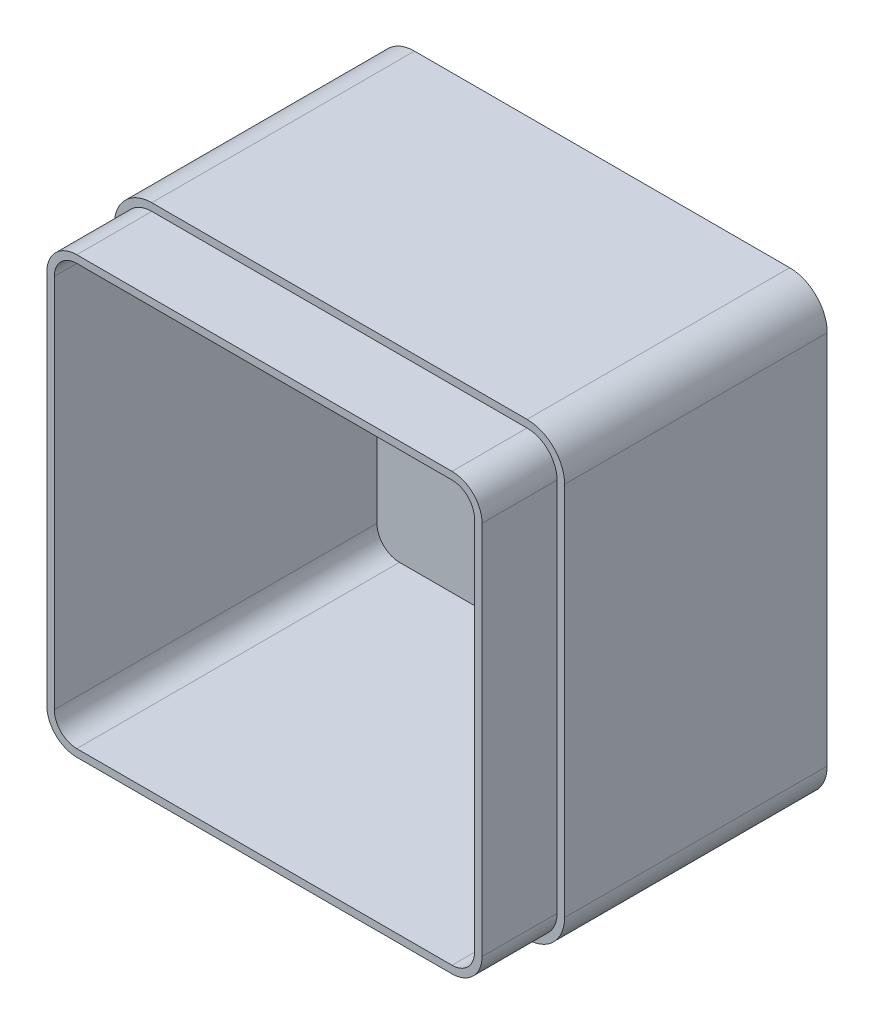
ISO-10303-21;
HEADER;
FILE_DESCRIPTION(('STEP AP214'),'2;1');
FILE_NAME('part.step','',(''),(''),'','','');
FILE_SCHEMA(('AUTOMOTIVE_DESIGN { 1 0 10303 214 1 1 1 1 }'));
ENDSEC;
DATA;
#1=APPLICATION_CONTEXT('core data for automotive mechanical design processes');
#2=APPLICATION_PROTOCOL_DEFINITION('international standard','automotive_design',2000,#1);
#3=PRODUCT_CONTEXT('',#1,'mechanical');
#4=PRODUCT('Part','Part','',(#3));
#5=PRODUCT_RELATED_PRODUCT_CATEGORY('part','',(#4));
#6=PRODUCT_DEFINITION_FORMATION('','',#4);
#7=PRODUCT_DEFINITION_CONTEXT('part definition',#1,'design');
#8=PRODUCT_DEFINITION('design','',#6,#7);
#9=PRODUCT_DEFINITION_SHAPE('','',#8);
#10=(LENGTH_UNIT() NAMED_UNIT(*) SI_UNIT(.MILLI.,.METRE.));
#11=(NAMED_UNIT(*) PLANE_ANGLE_UNIT() SI_UNIT($,.RADIAN.));
#12=(NAMED_UNIT(*) SI_UNIT($,.STERADIAN.) SOLID_ANGLE_UNIT());
#13=UNCERTAINTY_MEASURE_WITH_UNIT(LENGTH_MEASURE(1.E-05),#10,'distance_accuracy_value','');
#14=(GEOMETRIC_REPRESENTATION_CONTEXT(3) GLOBAL_UNCERTAINTY_ASSIGNED_CONTEXT((#13)) GLOBAL_UNIT_ASSIGNED_CONTEXT((#10,
#11,#12)) REPRESENTATION_CONTEXT('',''));
#15=CARTESIAN_POINT('',(0.,0.,0.));
#16=DIRECTION('',(0.,0.,1.));
#17=DIRECTION('',(1.,0.,0.));
#18=AXIS2_PLACEMENT_3D('',#15,#16,#17);
#19=CARTESIAN_POINT('',(0.,0.,90.));
#20=DIRECTION('',(0.,0.,-1.));
#21=DIRECTION('',(-1.,0.,0.));
#22=AXIS2_PLACEMENT_3D('',#19,#20,#21);
#23=PLANE('',#22);
#24=DIRECTION('',(0.,-1.,0.));
#25=VECTOR('',#24,1.);
#26=CARTESIAN_POINT('',(4.,0.,90.));
#27=LINE('',#26,#25);
#28=CARTESIAN_POINT('',(4.,110.,90.));
#29=VERTEX_POINT('',#28);
#30=CARTESIAN_POINT('',(4.,9.99999999999999,90.));
#31=VERTEX_POINT('',#30);
#32=EDGE_CURVE('E349',#29,#31,#27,.T.);
#33=ORIENTED_EDGE('',*,*,#32,.F.);
#34=CARTESIAN_POINT('',(10.,110.,90.));
#35=DIRECTION('',(0.,0.,-1.));
#36=DIRECTION('',(-1.,0.,0.));
#37=AXIS2_PLACEMENT_3D('',#34,#35,#36);
#38=CIRCLE('',#37,6.);
#39=CARTESIAN_POINT('',(9.99999999999999,116.,90.));
#40=VERTEX_POINT('',#39);
#41=EDGE_CURVE('E327',#40,#29,#38,.F.);
#42=ORIENTED_EDGE('',*,*,#41,.F.);
#43=DIRECTION('',(-1.,0.,0.));
#44=VECTOR('',#43,1.);
#45=CARTESIAN_POINT('',(0.,116.,90.));
#46=LINE('',#45,#44);
#47=CARTESIAN_POINT('',(110.,116.,90.));
#48=VERTEX_POINT('',#47);
#49=EDGE_CURVE('E363',#48,#40,#46,.T.);
#50=ORIENTED_EDGE('',*,*,#49,.F.);
#51=CARTESIAN_POINT('',(110.,110.,90.));
#52=DIRECTION('',(0.,0.,-1.));
#53=DIRECTION('',(-1.,0.,0.));
#54=AXIS2_PLACEMENT_3D('',#51,#52,#53);
#55=CIRCLE('',#54,6.);
#56=CARTESIAN_POINT('',(116.,110.,90.));
#57=VERTEX_POINT('',#56);
#58=EDGE_CURVE('E394',#57,#48,#55,.F.);
#59=ORIENTED_EDGE('',*,*,#58,.F.);
#60=DIRECTION('',(0.,1.,0.));
#61=VECTOR('',#60,1.);
#62=CARTESIAN_POINT('',(116.,0.,90.));
#63=LINE('',#62,#61);
#64=CARTESIAN_POINT('',(116.,9.99999999999999,90.));
#65=VERTEX_POINT('',#64);
#66=EDGE_CURVE('E391',#65,#57,#63,.T.);
#67=ORIENTED_EDGE('',*,*,#66,.F.);
#68=CARTESIAN_POINT('',(110.,10.,90.));
#69=DIRECTION('',(0.,0.,-1.));
#70=DIRECTION('',(-1.,0.,0.));
#71=AXIS2_PLACEMENT_3D('',#68,#69,#70);
#72=CIRCLE('',#71,6.);
#73=CARTESIAN_POINT('',(110.,4.,90.));
#74=VERTEX_POINT('',#73);
#75=EDGE_CURVE('E387',#74,#65,#72,.F.);
#76=ORIENTED_EDGE('',*,*,#75,.F.);
#77=DIRECTION('',(1.,0.,0.));
#78=VECTOR('',#77,1.);
#79=CARTESIAN_POINT('',(0.,4.,90.));
#80=LINE('',#79,#78);
#81=CARTESIAN_POINT('',(9.99999999999999,4.,90.));
#82=VERTEX_POINT('',#81);
#83=EDGE_CURVE('E384',#82,#74,#80,.T.);
#84=ORIENTED_EDGE('',*,*,#83,.F.);
#85=CARTESIAN_POINT('',(10.,10.,90.));
#86=DIRECTION('',(0.,0.,-1.));
#87=DIRECTION('',(-1.,0.,0.));
#88=AXIS2_PLACEMENT_3D('',#85,#86,#87);
#89=CIRCLE('',#88,6.);
#90=EDGE_CURVE('E372',#31,#82,#89,.F.);
#91=ORIENTED_EDGE('',*,*,#90,.F.);
#92=EDGE_LOOP('',(#33,#42,#50,#59,#67,#76,#84,#91));
#93=FACE_BOUND('',#92,.T.);
#94=CARTESIAN_POINT('',(10.,110.,90.));
#95=DIRECTION('',(0.,0.,1.));
#96=DIRECTION('',(1.,0.,0.));
#97=AXIS2_PLACEMENT_3D('',#94,#95,#96);
#98=CIRCLE('',#97,8.);
#99=CARTESIAN_POINT('',(9.99999999999999,118.,90.));
#100=VERTEX_POINT('',#99);
#101=CARTESIAN_POINT('',(2.,110.,90.));
#102=VERTEX_POINT('',#101);
#103=EDGE_CURVE('E255',#100,#102,#98,.T.);
#104=ORIENTED_EDGE('',*,*,#103,.T.);
#105=DIRECTION('',(0.,-1.,0.));
#106=VECTOR('',#105,1.);
#107=CARTESIAN_POINT('',(2.,110.,90.));
#108=LINE('',#107,#106);
#109=CARTESIAN_POINT('',(2.,9.99999999999999,90.));
#110=VERTEX_POINT('',#109);
#111=EDGE_CURVE('E205',#102,#110,#108,.T.);
#112=ORIENTED_EDGE('',*,*,#111,.T.);
#113=CARTESIAN_POINT('',(10.,10.,90.));
#114=DIRECTION('',(0.,0.,1.));
#115=DIRECTION('',(1.,0.,0.));
#116=AXIS2_PLACEMENT_3D('',#113,#114,#115);
#117=CIRCLE('',#116,8.);
#118=CARTESIAN_POINT('',(9.99999999999999,2.,90.));
#119=VERTEX_POINT('',#118);
#120=EDGE_CURVE('E54',#110,#119,#117,.T.);
#121=ORIENTED_EDGE('',*,*,#120,.T.);
#122=DIRECTION('',(1.,0.,0.));
#123=VECTOR('',#122,1.);
#124=CARTESIAN_POINT('',(9.99999999999999,2.,90.));
#125=LINE('',#124,#123);
#126=CARTESIAN_POINT('',(110.,2.,90.));
#127=VERTEX_POINT('',#126);
#128=EDGE_CURVE('E262',#119,#127,#125,.T.);
#129=ORIENTED_EDGE('',*,*,#128,.T.);
#130=CARTESIAN_POINT('',(110.,10.,90.));
#131=DIRECTION('',(0.,0.,1.));
#132=DIRECTION('',(1.,0.,0.));
#133=AXIS2_PLACEMENT_3D('',#130,#131,#132);
#134=CIRCLE('',#133,7.99999999999999);
#135=CARTESIAN_POINT('',(118.,10.,90.));
#136=VERTEX_POINT('',#135);
#137=EDGE_CURVE('E266',#127,#136,#134,.T.);
#138=ORIENTED_EDGE('',*,*,#137,.T.);
#139=DIRECTION('',(0.,1.,0.));
#140=VECTOR('',#139,1.);
#141=CARTESIAN_POINT('',(118.,9.99999999999999,90.));
#142=LINE('',#141,#140);
#143=CARTESIAN_POINT('',(118.,110.,90.));
#144=VERTEX_POINT('',#143);
#145=EDGE_CURVE('E270',#136,#144,#142,.T.);
#146=ORIENTED_EDGE('',*,*,#145,.T.);
#147=CARTESIAN_POINT('',(110.,110.,90.));
#148=DIRECTION('',(0.,0.,1.));
#149=DIRECTION('',(1.,0.,0.));
#150=AXIS2_PLACEMENT_3D('',#147,#148,#149);
#151=CIRCLE('',#150,7.99999999999999);
#152=CARTESIAN_POINT('',(110.,118.,90.));
#153=VERTEX_POINT('',#152);
#154=EDGE_CURVE('E232',#144,#153,#151,.T.);
#155=ORIENTED_EDGE('',*,*,#154,.T.);
#156=DIRECTION('',(-1.,0.,0.));
#157=VECTOR('',#156,1.);
#158=CARTESIAN_POINT('',(110.,118.,90.));
#159=LINE('',#158,#157);
#160=EDGE_CURVE('E228',#153,#100,#159,.T.);
#161=ORIENTED_EDGE('',*,*,#160,.T.);
#162=EDGE_LOOP('',(#104,#112,#121,#129,#138,#146,#155,#161));
#163=FACE_BOUND('',#162,.T.);
#164=ADVANCED_FACE('F38',(#93,#163),#23,.F.);
#165=CARTESIAN_POINT('',(4.,0.,90.));
#166=DIRECTION('',(1.,0.,0.));
#167=DIRECTION('',(0.,0.,-1.));
#168=AXIS2_PLACEMENT_3D('',#165,#166,#167);
#169=PLANE('',#168);
#170=DIRECTION('',(0.,-1.,0.));
#171=VECTOR('',#170,1.);
#172=CARTESIAN_POINT('',(4.,0.,4.));
#173=LINE('',#172,#171);
#174=CARTESIAN_POINT('',(4.,110.,4.));
#175=VERTEX_POINT('',#174);
#176=CARTESIAN_POINT('',(4.,9.99999999999999,4.));
#177=VERTEX_POINT('',#176);
#178=EDGE_CURVE('E319',#175,#177,#173,.T.);
#179=ORIENTED_EDGE('',*,*,#178,.F.);
#180=DIRECTION('',(0.,0.,-1.));
#181=VECTOR('',#180,1.);
#182=CARTESIAN_POINT('',(4.,110.,90.));
#183=LINE('',#182,#181);
#184=EDGE_CURVE('E328',#29,#175,#183,.T.);
#185=ORIENTED_EDGE('',*,*,#184,.F.);
#186=ORIENTED_EDGE('',*,*,#32,.T.);
#187=DIRECTION('',(0.,0.,-1.));
#188=VECTOR('',#187,1.);
#189=CARTESIAN_POINT('',(4.,9.99999999999999,90.));
#190=LINE('',#189,#188);
#191=EDGE_CURVE('E324',#177,#31,#190,.F.);
#192=ORIENTED_EDGE('',*,*,#191,.F.);
#193=EDGE_LOOP('',(#179,#185,#186,#192));
#194=FACE_BOUND('',#193,.T.);
#195=ADVANCED_FACE('F504',(#194),#169,.T.);
#196=CARTESIAN_POINT('',(0.,4.,90.));
#197=DIRECTION('',(0.,1.,0.));
#198=DIRECTION('',(0.,0.,1.));
#199=AXIS2_PLACEMENT_3D('',#196,#197,#198);
#200=PLANE('',#199);
#201=ORIENTED_EDGE('',*,*,#83,.T.);
#202=DIRECTION('',(0.,0.,1.));
#203=VECTOR('',#202,1.);
#204=CARTESIAN_POINT('',(110.,4.,90.));
#205=LINE('',#204,#203);
#206=CARTESIAN_POINT('',(110.,4.,4.));
#207=VERTEX_POINT('',#206);
#208=EDGE_CURVE('E360',#207,#74,#205,.T.);
#209=ORIENTED_EDGE('',*,*,#208,.F.);
#210=DIRECTION('',(1.,0.,0.));
#211=VECTOR('',#210,1.);
#212=CARTESIAN_POINT('',(0.,4.,4.));
#213=LINE('',#212,#211);
#214=CARTESIAN_POINT('',(9.99999999999999,4.,4.));
#215=VERTEX_POINT('',#214);
#216=EDGE_CURVE('E323',#215,#207,#213,.T.);
#217=ORIENTED_EDGE('',*,*,#216,.F.);
#218=DIRECTION('',(0.,0.,1.));
#219=VECTOR('',#218,1.);
#220=CARTESIAN_POINT('',(9.99999999999999,4.,90.));
#221=LINE('',#220,#219);
#222=EDGE_CURVE('E344',#82,#215,#221,.F.);
#223=ORIENTED_EDGE('',*,*,#222,.F.);
#224=EDGE_LOOP('',(#201,#209,#217,#223));
#225=FACE_BOUND('',#224,.T.);
#226=ADVANCED_FACE('F510',(#225),#200,.T.);
#227=CARTESIAN_POINT('',(116.,0.,90.));
#228=DIRECTION('',(-1.,0.,0.));
#229=DIRECTION('',(0.,0.,1.));
#230=AXIS2_PLACEMENT_3D('',#227,#228,#229);
#231=PLANE('',#230);
#232=ORIENTED_EDGE('',*,*,#66,.T.);
#233=DIRECTION('',(0.,0.,1.));
#234=VECTOR('',#233,1.);
#235=CARTESIAN_POINT('',(116.,110.,90.));
#236=LINE('',#235,#234);
#237=CARTESIAN_POINT('',(116.,110.,4.));
#238=VERTEX_POINT('',#237);
#239=EDGE_CURVE('E369',#238,#57,#236,.T.);
#240=ORIENTED_EDGE('',*,*,#239,.F.);
#241=DIRECTION('',(0.,1.,0.));
#242=VECTOR('',#241,1.);
#243=CARTESIAN_POINT('',(116.,0.,4.));
#244=LINE('',#243,#242);
#245=CARTESIAN_POINT('',(116.,9.99999999999999,4.));
#246=VERTEX_POINT('',#245);
#247=EDGE_CURVE('E336',#246,#238,#244,.T.);
#248=ORIENTED_EDGE('',*,*,#247,.F.);
#249=DIRECTION('',(0.,0.,1.));
#250=VECTOR('',#249,1.);
#251=CARTESIAN_POINT('',(116.,9.99999999999999,90.));
#252=LINE('',#251,#250);
#253=EDGE_CURVE('E364',#65,#246,#252,.F.);
#254=ORIENTED_EDGE('',*,*,#253,.F.);
#255=EDGE_LOOP('',(#232,#240,#248,#254));
#256=FACE_BOUND('',#255,.T.);
#257=ADVANCED_FACE('F539',(#256),#231,.T.);
#258=CARTESIAN_POINT('',(0.,116.,90.));
#259=DIRECTION('',(0.,-1.,0.));
#260=DIRECTION('',(0.,0.,-1.));
#261=AXIS2_PLACEMENT_3D('',#258,#259,#260);
#262=PLANE('',#261);
#263=ORIENTED_EDGE('',*,*,#49,.T.);
#264=DIRECTION('',(0.,0.,-1.));
#265=VECTOR('',#264,1.);
#266=CARTESIAN_POINT('',(9.99999999999999,116.,90.));
#267=LINE('',#266,#265);
#268=CARTESIAN_POINT('',(9.99999999999999,116.,4.));
#269=VERTEX_POINT('',#268);
#270=EDGE_CURVE('E368',#269,#40,#267,.F.);
#271=ORIENTED_EDGE('',*,*,#270,.F.);
#272=DIRECTION('',(-1.,0.,0.));
#273=VECTOR('',#272,1.);
#274=CARTESIAN_POINT('',(0.,116.,4.));
#275=LINE('',#274,#273);
#276=CARTESIAN_POINT('',(110.,116.,4.));
#277=VERTEX_POINT('',#276);
#278=EDGE_CURVE('E345',#277,#269,#275,.T.);
#279=ORIENTED_EDGE('',*,*,#278,.F.);
#280=DIRECTION('',(0.,0.,-1.));
#281=VECTOR('',#280,1.);
#282=CARTESIAN_POINT('',(110.,116.,90.));
#283=LINE('',#282,#281);
#284=EDGE_CURVE('E373',#48,#277,#283,.T.);
#285=ORIENTED_EDGE('',*,*,#284,.F.);
#286=EDGE_LOOP('',(#263,#271,#279,#285));
#287=FACE_BOUND('',#286,.T.);
#288=ADVANCED_FACE('F535',(#287),#262,.T.);
#289=CARTESIAN_POINT('',(0.,0.,4.));
#290=DIRECTION('',(0.,0.,-1.));
#291=DIRECTION('',(-1.,0.,0.));
#292=AXIS2_PLACEMENT_3D('',#289,#290,#291);
#293=PLANE('',#292);
#294=ORIENTED_EDGE('',*,*,#216,.T.);
#295=CARTESIAN_POINT('',(110.,10.,4.));
#296=DIRECTION('',(0.,0.,-1.));
#297=DIRECTION('',(-1.,0.,0.));
#298=AXIS2_PLACEMENT_3D('',#295,#296,#297);
#299=CIRCLE('',#298,6.);
#300=EDGE_CURVE('E339',#246,#207,#299,.T.);
#301=ORIENTED_EDGE('',*,*,#300,.F.);
#302=ORIENTED_EDGE('',*,*,#247,.T.);
#303=CARTESIAN_POINT('',(110.,110.,4.));
#304=DIRECTION('',(0.,0.,-1.));
#305=DIRECTION('',(-1.,0.,0.));
#306=AXIS2_PLACEMENT_3D('',#303,#304,#305);
#307=CIRCLE('',#306,6.);
#308=EDGE_CURVE('E343',#277,#238,#307,.T.);
#309=ORIENTED_EDGE('',*,*,#308,.F.);
#310=ORIENTED_EDGE('',*,*,#278,.T.);
#311=CARTESIAN_POINT('',(10.,110.,4.));
#312=DIRECTION('',(0.,0.,-1.));
#313=DIRECTION('',(-1.,0.,0.));
#314=AXIS2_PLACEMENT_3D('',#311,#312,#313);
#315=CIRCLE('',#314,6.);
#316=EDGE_CURVE('E340',#175,#269,#315,.T.);
#317=ORIENTED_EDGE('',*,*,#316,.F.);
#318=ORIENTED_EDGE('',*,*,#178,.T.);
#319=CARTESIAN_POINT('',(10.,10.,4.));
#320=DIRECTION('',(0.,0.,-1.));
#321=DIRECTION('',(-1.,0.,0.));
#322=AXIS2_PLACEMENT_3D('',#319,#320,#321);
#323=CIRCLE('',#322,6.);
#324=EDGE_CURVE('E332',#215,#177,#323,.T.);
#325=ORIENTED_EDGE('',*,*,#324,.F.);
#326=EDGE_LOOP('',(#294,#301,#302,#309,#310,#317,#318,#325));
#327=FACE_BOUND('',#326,.T.);
#328=ADVANCED_FACE('F531',(#327),#293,.F.);
#329=CARTESIAN_POINT('',(10.,10.,90.));
#330=DIRECTION('',(0.,0.,-1.));
#331=DIRECTION('',(-1.,0.,0.));
#332=AXIS2_PLACEMENT_3D('',#329,#330,#331);
#333=CYLINDRICAL_SURFACE('',#332,6.);
#334=ORIENTED_EDGE('',*,*,#90,.T.);
#335=ORIENTED_EDGE('',*,*,#222,.T.);
#336=ORIENTED_EDGE('',*,*,#324,.T.);
#337=ORIENTED_EDGE('',*,*,#191,.T.);
#338=EDGE_LOOP('',(#334,#335,#336,#337));
#339=FACE_BOUND('',#338,.T.);
#340=ADVANCED_FACE('F527',(#339),#333,.F.);
#341=CARTESIAN_POINT('',(110.,10.,90.));
#342=DIRECTION('',(0.,0.,-1.));
#343=DIRECTION('',(-1.,0.,0.));
#344=AXIS2_PLACEMENT_3D('',#341,#342,#343);
#345=CYLINDRICAL_SURFACE('',#344,6.);
#346=ORIENTED_EDGE('',*,*,#75,.T.);
#347=ORIENTED_EDGE('',*,*,#253,.T.);
#348=ORIENTED_EDGE('',*,*,#300,.T.);
#349=ORIENTED_EDGE('',*,*,#208,.T.);
#350=EDGE_LOOP('',(#346,#347,#348,#349));
#351=FACE_BOUND('',#350,.T.);
#352=ADVANCED_FACE('F523',(#351),#345,.F.);
#353=CARTESIAN_POINT('',(110.,110.,90.));
#354=DIRECTION('',(0.,0.,-1.));
#355=DIRECTION('',(-1.,0.,0.));
#356=AXIS2_PLACEMENT_3D('',#353,#354,#355);
#357=CYLINDRICAL_SURFACE('',#356,6.);
#358=ORIENTED_EDGE('',*,*,#58,.T.);
#359=ORIENTED_EDGE('',*,*,#284,.T.);
#360=ORIENTED_EDGE('',*,*,#308,.T.);
#361=ORIENTED_EDGE('',*,*,#239,.T.);
#362=EDGE_LOOP('',(#358,#359,#360,#361));
#363=FACE_BOUND('',#362,.T.);
#364=ADVANCED_FACE('F519',(#363),#357,.F.);
#365=CARTESIAN_POINT('',(10.,110.,90.));
#366=DIRECTION('',(0.,0.,-1.));
#367=DIRECTION('',(-1.,0.,0.));
#368=AXIS2_PLACEMENT_3D('',#365,#366,#367);
#369=CYLINDRICAL_SURFACE('',#368,6.);
#370=ORIENTED_EDGE('',*,*,#41,.T.);
#371=ORIENTED_EDGE('',*,*,#184,.T.);
#372=ORIENTED_EDGE('',*,*,#316,.T.);
#373=ORIENTED_EDGE('',*,*,#270,.T.);
#374=EDGE_LOOP('',(#370,#371,#372,#373));
#375=FACE_BOUND('',#374,.T.);
#376=ADVANCED_FACE('F516',(#375),#369,.F.);
#377=CARTESIAN_POINT('',(10.,110.,70.));
#378=DIRECTION('',(0.,0.,1.));
#379=DIRECTION('',(1.,0.,0.));
#380=AXIS2_PLACEMENT_3D('',#377,#378,#379);
#381=PLANE('',#380);
#382=DIRECTION('',(-1.,0.,0.));
#383=VECTOR('',#382,1.);
#384=CARTESIAN_POINT('',(110.,118.,70.));
#385=LINE('',#384,#383);
#386=CARTESIAN_POINT('',(110.,118.,70.));
#387=VERTEX_POINT('',#386);
#388=CARTESIAN_POINT('',(9.99999999999999,118.,70.));
#389=VERTEX_POINT('',#388);
#390=EDGE_CURVE('E212',#387,#389,#385,.T.);
#391=ORIENTED_EDGE('',*,*,#390,.F.);
#392=CARTESIAN_POINT('',(110.,110.,70.));
#393=DIRECTION('',(0.,0.,1.));
#394=DIRECTION('',(1.,0.,0.));
#395=AXIS2_PLACEMENT_3D('',#392,#393,#394);
#396=CIRCLE('',#395,7.99999999999999);
#397=CARTESIAN_POINT('',(118.,110.,70.));
#398=VERTEX_POINT('',#397);
#399=EDGE_CURVE('E249',#398,#387,#396,.T.);
#400=ORIENTED_EDGE('',*,*,#399,.F.);
#401=DIRECTION('',(0.,1.,0.));
#402=VECTOR('',#401,1.);
#403=CARTESIAN_POINT('',(118.,9.99999999999999,70.));
#404=LINE('',#403,#402);
#405=CARTESIAN_POINT('',(118.,10.,70.));
#406=VERTEX_POINT('',#405);
#407=EDGE_CURVE('E245',#406,#398,#404,.T.);
#408=ORIENTED_EDGE('',*,*,#407,.F.);
#409=CARTESIAN_POINT('',(110.,10.,70.));
#410=DIRECTION('',(0.,0.,1.));
#411=DIRECTION('',(1.,0.,0.));
#412=AXIS2_PLACEMENT_3D('',#409,#410,#411);
#413=CIRCLE('',#412,7.99999999999999);
#414=CARTESIAN_POINT('',(110.,2.,70.));
#415=VERTEX_POINT('',#414);
#416=EDGE_CURVE('E241',#415,#406,#413,.T.);
#417=ORIENTED_EDGE('',*,*,#416,.F.);
#418=DIRECTION('',(1.,0.,0.));
#419=VECTOR('',#418,1.);
#420=CARTESIAN_POINT('',(9.99999999999999,2.,70.));
#421=LINE('',#420,#419);
#422=CARTESIAN_POINT('',(9.99999999999999,2.,70.));
#423=VERTEX_POINT('',#422);
#424=EDGE_CURVE('E237',#423,#415,#421,.T.);
#425=ORIENTED_EDGE('',*,*,#424,.F.);
#426=CARTESIAN_POINT('',(10.,10.,70.));
#427=DIRECTION('',(0.,0.,1.));
#428=DIRECTION('',(1.,0.,0.));
#429=AXIS2_PLACEMENT_3D('',#426,#427,#428);
#430=CIRCLE('',#429,8.);
#431=CARTESIAN_POINT('',(2.,9.99999999999999,70.));
#432=VERTEX_POINT('',#431);
#433=EDGE_CURVE('E222',#432,#423,#430,.T.);
#434=ORIENTED_EDGE('',*,*,#433,.F.);
#435=DIRECTION('',(0.,-1.,0.));
#436=VECTOR('',#435,1.);
#437=CARTESIAN_POINT('',(2.,110.,70.));
#438=LINE('',#437,#436);
#439=CARTESIAN_POINT('',(2.,110.,70.));
#440=VERTEX_POINT('',#439);
#441=EDGE_CURVE('E203',#440,#432,#438,.T.);
#442=ORIENTED_EDGE('',*,*,#441,.F.);
#443=CARTESIAN_POINT('',(10.,110.,70.));
#444=DIRECTION('',(0.,0.,1.));
#445=DIRECTION('',(1.,0.,0.));
#446=AXIS2_PLACEMENT_3D('',#443,#444,#445);
#447=CIRCLE('',#446,8.);
#448=EDGE_CURVE('E218',#389,#440,#447,.T.);
#449=ORIENTED_EDGE('',*,*,#448,.F.);
#450=EDGE_LOOP('',(#391,#400,#408,#417,#425,#434,#442,#449));
#451=FACE_BOUND('',#450,.T.);
#452=CARTESIAN_POINT('',(10.,110.,70.));
#453=DIRECTION('',(0.,0.,1.));
#454=DIRECTION('',(1.,0.,0.));
#455=AXIS2_PLACEMENT_3D('',#452,#453,#454);
#456=CIRCLE('',#455,10.);
#457=CARTESIAN_POINT('',(10.,120.,70.));
#458=VERTEX_POINT('',#457);
#459=CARTESIAN_POINT('',(0.,110.,70.));
#460=VERTEX_POINT('',#459);
#461=EDGE_CURVE('E279',#458,#460,#456,.T.);
#462=ORIENTED_EDGE('',*,*,#461,.T.);
#463=DIRECTION('',(0.,-1.,0.));
#464=VECTOR('',#463,1.);
#465=CARTESIAN_POINT('',(0.,110.,70.));
#466=LINE('',#465,#464);
#467=CARTESIAN_POINT('',(0.,10.,70.));
#468=VERTEX_POINT('',#467);
#469=EDGE_CURVE('E299',#460,#468,#466,.T.);
#470=ORIENTED_EDGE('',*,*,#469,.T.);
#471=CARTESIAN_POINT('',(10.,10.,70.));
#472=DIRECTION('',(0.,0.,1.));
#473=DIRECTION('',(1.,0.,0.));
#474=AXIS2_PLACEMENT_3D('',#471,#472,#473);
#475=CIRCLE('',#474,10.);
#476=CARTESIAN_POINT('',(9.99999999999999,0.,70.));
#477=VERTEX_POINT('',#476);
#478=EDGE_CURVE('E302',#468,#477,#475,.T.);
#479=ORIENTED_EDGE('',*,*,#478,.T.);
#480=DIRECTION('',(1.,0.,0.));
#481=VECTOR('',#480,1.);
#482=CARTESIAN_POINT('',(9.99999999999999,0.,70.));
#483=LINE('',#482,#481);
#484=CARTESIAN_POINT('',(110.,0.,70.));
#485=VERTEX_POINT('',#484);
#486=EDGE_CURVE('E305',#477,#485,#483,.T.);
#487=ORIENTED_EDGE('',*,*,#486,.T.);
#488=CARTESIAN_POINT('',(110.,10.,70.));
#489=DIRECTION('',(0.,0.,1.));
#490=DIRECTION('',(1.,0.,0.));
#491=AXIS2_PLACEMENT_3D('',#488,#489,#490);
#492=CIRCLE('',#491,9.99999999999999);
#493=CARTESIAN_POINT('',(120.,10.,70.));
#494=VERTEX_POINT('',#493);
#495=EDGE_CURVE('E308',#485,#494,#492,.T.);
#496=ORIENTED_EDGE('',*,*,#495,.T.);
#497=DIRECTION('',(0.,1.,0.));
#498=VECTOR('',#497,1.);
#499=CARTESIAN_POINT('',(120.,10.,70.));
#500=LINE('',#499,#498);
#501=CARTESIAN_POINT('',(120.,110.,70.));
#502=VERTEX_POINT('',#501);
#503=EDGE_CURVE('E311',#494,#502,#500,.T.);
#504=ORIENTED_EDGE('',*,*,#503,.T.);
#505=CARTESIAN_POINT('',(110.,110.,70.));
#506=DIRECTION('',(0.,0.,1.));
#507=DIRECTION('',(1.,0.,0.));
#508=AXIS2_PLACEMENT_3D('',#505,#506,#507);
#509=CIRCLE('',#508,9.99999999999999);
#510=CARTESIAN_POINT('',(110.,120.,70.));
#511=VERTEX_POINT('',#510);
#512=EDGE_CURVE('E314',#502,#511,#509,.T.);
#513=ORIENTED_EDGE('',*,*,#512,.T.);
#514=DIRECTION('',(-1.,0.,0.));
#515=VECTOR('',#514,1.);
#516=CARTESIAN_POINT('',(110.,120.,70.));
#517=LINE('',#516,#515);
#518=EDGE_CURVE('E62',#511,#458,#517,.T.);
#519=ORIENTED_EDGE('',*,*,#518,.T.);
#520=EDGE_LOOP('',(#462,#470,#479,#487,#496,#504,#513,#519));
#521=FACE_BOUND('',#520,.T.);
#522=ADVANCED_FACE('F217',(#451,#521),#381,.T.);
#523=CARTESIAN_POINT('',(10.,110.,70.));
#524=DIRECTION('',(0.,0.,1.));
#525=DIRECTION('',(1.,0.,0.));
#526=AXIS2_PLACEMENT_3D('',#523,#524,#525);
#527=CYLINDRICAL_SURFACE('',#526,8.);
#528=ORIENTED_EDGE('',*,*,#103,.F.);
#529=DIRECTION('',(0.,0.,1.));
#530=VECTOR('',#529,1.);
#531=CARTESIAN_POINT('',(9.99999999999999,118.,70.));
#532=LINE('',#531,#530);
#533=EDGE_CURVE('E226',#389,#100,#532,.T.);
#534=ORIENTED_EDGE('',*,*,#533,.F.);
#535=ORIENTED_EDGE('',*,*,#448,.T.);
#536=DIRECTION('',(0.,0.,1.));
#537=VECTOR('',#536,1.);
#538=CARTESIAN_POINT('',(2.,110.,70.));
#539=LINE('',#538,#537);
#540=EDGE_CURVE('E200',#440,#102,#539,.T.);
#541=ORIENTED_EDGE('',*,*,#540,.T.);
#542=EDGE_LOOP('',(#528,#534,#535,#541));
#543=FACE_BOUND('',#542,.T.);
#544=ADVANCED_FACE('F225',(#543),#527,.T.);
#545=CARTESIAN_POINT('',(110.,118.,70.));
#546=DIRECTION('',(0.,1.,0.));
#547=DIRECTION('',(0.,0.,1.));
#548=AXIS2_PLACEMENT_3D('',#545,#546,#547);
#549=PLANE('',#548);
#550=ORIENTED_EDGE('',*,*,#160,.F.);
#551=DIRECTION('',(0.,0.,1.));
#552=VECTOR('',#551,1.);
#553=CARTESIAN_POINT('',(110.,118.,70.));
#554=LINE('',#553,#552);
#555=EDGE_CURVE('E280',#387,#153,#554,.T.);
#556=ORIENTED_EDGE('',*,*,#555,.F.);
#557=ORIENTED_EDGE('',*,*,#390,.T.);
#558=ORIENTED_EDGE('',*,*,#533,.T.);
#559=EDGE_LOOP('',(#550,#556,#557,#558));
#560=FACE_BOUND('',#559,.T.);
#561=ADVANCED_FACE('F550',(#560),#549,.T.);
#562=CARTESIAN_POINT('',(110.,110.,70.));
#563=DIRECTION('',(0.,0.,1.));
#564=DIRECTION('',(1.,0.,0.));
#565=AXIS2_PLACEMENT_3D('',#562,#563,#564);
#566=CYLINDRICAL_SURFACE('',#565,7.99999999999999);
#567=ORIENTED_EDGE('',*,*,#154,.F.);
#568=DIRECTION('',(0.,0.,1.));
#569=VECTOR('',#568,1.);
#570=CARTESIAN_POINT('',(118.,110.,70.));
#571=LINE('',#570,#569);
#572=EDGE_CURVE('E283',#398,#144,#571,.T.);
#573=ORIENTED_EDGE('',*,*,#572,.F.);
#574=ORIENTED_EDGE('',*,*,#399,.T.);
#575=ORIENTED_EDGE('',*,*,#555,.T.);
#576=EDGE_LOOP('',(#567,#573,#574,#575));
#577=FACE_BOUND('',#576,.T.);
#578=ADVANCED_FACE('F565',(#577),#566,.T.);
#579=CARTESIAN_POINT('',(118.,9.99999999999999,70.));
#580=DIRECTION('',(1.,0.,0.));
#581=DIRECTION('',(0.,0.,-1.));
#582=AXIS2_PLACEMENT_3D('',#579,#580,#581);
#583=PLANE('',#582);
#584=ORIENTED_EDGE('',*,*,#145,.F.);
#585=DIRECTION('',(0.,0.,1.));
#586=VECTOR('',#585,1.);
#587=CARTESIAN_POINT('',(118.,10.,70.));
#588=LINE('',#587,#586);
#589=EDGE_CURVE('E286',#406,#136,#588,.T.);
#590=ORIENTED_EDGE('',*,*,#589,.F.);
#591=ORIENTED_EDGE('',*,*,#407,.T.);
#592=ORIENTED_EDGE('',*,*,#572,.T.);
#593=EDGE_LOOP('',(#584,#590,#591,#592));
#594=FACE_BOUND('',#593,.T.);
#595=ADVANCED_FACE('F561',(#594),#583,.T.);
#596=CARTESIAN_POINT('',(110.,10.,70.));
#597=DIRECTION('',(0.,0.,1.));
#598=DIRECTION('',(1.,0.,0.));
#599=AXIS2_PLACEMENT_3D('',#596,#597,#598);
#600=CYLINDRICAL_SURFACE('',#599,7.99999999999999);
#601=ORIENTED_EDGE('',*,*,#137,.F.);
#602=DIRECTION('',(0.,0.,1.));
#603=VECTOR('',#602,1.);
#604=CARTESIAN_POINT('',(110.,2.,70.));
#605=LINE('',#604,#603);
#606=EDGE_CURVE('E289',#415,#127,#605,.T.);
#607=ORIENTED_EDGE('',*,*,#606,.F.);
#608=ORIENTED_EDGE('',*,*,#416,.T.);
#609=ORIENTED_EDGE('',*,*,#589,.T.);
#610=EDGE_LOOP('',(#601,#607,#608,#609));
#611=FACE_BOUND('',#610,.T.);
#612=ADVANCED_FACE('F557',(#611),#600,.T.);
#613=CARTESIAN_POINT('',(9.99999999999999,2.,70.));
#614=DIRECTION('',(0.,-1.,0.));
#615=DIRECTION('',(0.,0.,-1.));
#616=AXIS2_PLACEMENT_3D('',#613,#614,#615);
#617=PLANE('',#616);
#618=ORIENTED_EDGE('',*,*,#128,.F.);
#619=DIRECTION('',(0.,0.,1.));
#620=VECTOR('',#619,1.);
#621=CARTESIAN_POINT('',(9.99999999999999,2.,70.));
#622=LINE('',#621,#620);
#623=EDGE_CURVE('E292',#423,#119,#622,.T.);
#624=ORIENTED_EDGE('',*,*,#623,.F.);
#625=ORIENTED_EDGE('',*,*,#424,.T.);
#626=ORIENTED_EDGE('',*,*,#606,.T.);
#627=EDGE_LOOP('',(#618,#624,#625,#626));
#628=FACE_BOUND('',#627,.T.);
#629=ADVANCED_FACE('F554',(#628),#617,.T.);
#630=CARTESIAN_POINT('',(10.,10.,70.));
#631=DIRECTION('',(0.,0.,1.));
#632=DIRECTION('',(1.,0.,0.));
#633=AXIS2_PLACEMENT_3D('',#630,#631,#632);
#634=CYLINDRICAL_SURFACE('',#633,8.);
#635=ORIENTED_EDGE('',*,*,#120,.F.);
#636=DIRECTION('',(0.,0.,1.));
#637=VECTOR('',#636,1.);
#638=CARTESIAN_POINT('',(2.,9.99999999999999,70.));
#639=LINE('',#638,#637);
#640=EDGE_CURVE('E211',#432,#110,#639,.T.);
#641=ORIENTED_EDGE('',*,*,#640,.F.);
#642=ORIENTED_EDGE('',*,*,#433,.T.);
#643=ORIENTED_EDGE('',*,*,#623,.T.);
#644=EDGE_LOOP('',(#635,#641,#642,#643));
#645=FACE_BOUND('',#644,.T.);
#646=ADVANCED_FACE('F499',(#645),#634,.T.);
#647=CARTESIAN_POINT('',(2.,110.,70.));
#648=DIRECTION('',(-1.,0.,0.));
#649=DIRECTION('',(0.,0.,1.));
#650=AXIS2_PLACEMENT_3D('',#647,#648,#649);
#651=PLANE('',#650);
#652=ORIENTED_EDGE('',*,*,#111,.F.);
#653=ORIENTED_EDGE('',*,*,#540,.F.);
#654=ORIENTED_EDGE('',*,*,#441,.T.);
#655=ORIENTED_EDGE('',*,*,#640,.T.);
#656=EDGE_LOOP('',(#652,#653,#654,#655));
#657=FACE_BOUND('',#656,.T.);
#658=ADVANCED_FACE('F202',(#657),#651,.T.);
#659=CARTESIAN_POINT('',(0.,0.,0.));
#660=DIRECTION('',(0.,0.,-1.));
#661=DIRECTION('',(-1.,0.,0.));
#662=AXIS2_PLACEMENT_3D('',#659,#660,#661);
#663=PLANE('',#662);
#664=DIRECTION('',(1.,0.,0.));
#665=VECTOR('',#664,1.);
#666=CARTESIAN_POINT('',(0.,0.,0.));
#667=LINE('',#666,#665);
#668=CARTESIAN_POINT('',(9.99999999999999,0.,0.));
#669=VERTEX_POINT('',#668);
#670=CARTESIAN_POINT('',(110.,0.,0.));
#671=VERTEX_POINT('',#670);
#672=EDGE_CURVE('E407',#669,#671,#667,.T.);
#673=ORIENTED_EDGE('',*,*,#672,.F.);
#674=CARTESIAN_POINT('',(10.,10.,0.));
#675=DIRECTION('',(0.,0.,-1.));
#676=DIRECTION('',(-1.,0.,0.));
#677=AXIS2_PLACEMENT_3D('',#674,#675,#676);
#678=CIRCLE('',#677,10.);
#679=CARTESIAN_POINT('',(0.,10.,0.));
#680=VERTEX_POINT('',#679);
#681=EDGE_CURVE('E435',#669,#680,#678,.T.);
#682=ORIENTED_EDGE('',*,*,#681,.T.);
#683=DIRECTION('',(0.,-1.,0.));
#684=VECTOR('',#683,1.);
#685=CARTESIAN_POINT('',(0.,0.,0.));
#686=LINE('',#685,#684);
#687=CARTESIAN_POINT('',(0.,110.,0.));
#688=VERTEX_POINT('',#687);
#689=EDGE_CURVE('E377',#688,#680,#686,.T.);
#690=ORIENTED_EDGE('',*,*,#689,.F.);
#691=CARTESIAN_POINT('',(10.,110.,0.));
#692=DIRECTION('',(0.,0.,-1.));
#693=DIRECTION('',(-1.,0.,0.));
#694=AXIS2_PLACEMENT_3D('',#691,#692,#693);
#695=CIRCLE('',#694,10.);
#696=CARTESIAN_POINT('',(9.99999999999999,120.,0.));
#697=VERTEX_POINT('',#696);
#698=EDGE_CURVE('E426',#688,#697,#695,.T.);
#699=ORIENTED_EDGE('',*,*,#698,.T.);
#700=DIRECTION('',(-1.,0.,0.));
#701=VECTOR('',#700,1.);
#702=CARTESIAN_POINT('',(0.,120.,0.));
#703=LINE('',#702,#701);
#704=CARTESIAN_POINT('',(110.,120.,0.));
#705=VERTEX_POINT('',#704);
#706=EDGE_CURVE('E415',#705,#697,#703,.T.);
#707=ORIENTED_EDGE('',*,*,#706,.F.);
#708=CARTESIAN_POINT('',(110.,110.,0.));
#709=DIRECTION('',(0.,0.,-1.));
#710=DIRECTION('',(-1.,0.,0.));
#711=AXIS2_PLACEMENT_3D('',#708,#709,#710);
#712=CIRCLE('',#711,10.);
#713=CARTESIAN_POINT('',(120.,110.,0.));
#714=VERTEX_POINT('',#713);
#715=EDGE_CURVE('E429',#705,#714,#712,.T.);
#716=ORIENTED_EDGE('',*,*,#715,.T.);
#717=DIRECTION('',(0.,1.,0.));
#718=VECTOR('',#717,1.);
#719=CARTESIAN_POINT('',(120.,0.,0.));
#720=LINE('',#719,#718);
#721=CARTESIAN_POINT('',(120.,10.,0.));
#722=VERTEX_POINT('',#721);
#723=EDGE_CURVE('E411',#722,#714,#720,.T.);
#724=ORIENTED_EDGE('',*,*,#723,.F.);
#725=CARTESIAN_POINT('',(110.,10.,0.));
#726=DIRECTION('',(0.,0.,-1.));
#727=DIRECTION('',(-1.,0.,0.));
#728=AXIS2_PLACEMENT_3D('',#725,#726,#727);
#729=CIRCLE('',#728,10.);
#730=EDGE_CURVE('E432',#722,#671,#729,.T.);
#731=ORIENTED_EDGE('',*,*,#730,.T.);
#732=EDGE_LOOP('',(#673,#682,#690,#699,#707,#716,#724,#731));
#733=FACE_BOUND('',#732,.T.);
#734=ADVANCED_FACE('F491',(#733),#663,.T.);
#735=CARTESIAN_POINT('',(10.,110.,90.));
#736=DIRECTION('',(0.,0.,-1.));
#737=DIRECTION('',(-1.,0.,0.));
#738=AXIS2_PLACEMENT_3D('',#735,#736,#737);
#739=CYLINDRICAL_SURFACE('',#738,10.);
#740=DIRECTION('',(0.,0.,-1.));
#741=VECTOR('',#740,1.);
#742=CARTESIAN_POINT('',(0.,110.,90.));
#743=LINE('',#742,#741);
#744=EDGE_CURVE('E438',#460,#688,#743,.T.);
#745=ORIENTED_EDGE('',*,*,#744,.F.);
#746=ORIENTED_EDGE('',*,*,#461,.F.);
#747=DIRECTION('',(0.,0.,-1.));
#748=VECTOR('',#747,1.);
#749=CARTESIAN_POINT('',(10.,120.,90.));
#750=LINE('',#749,#748);
#751=EDGE_CURVE('E47',#697,#458,#750,.F.);
#752=ORIENTED_EDGE('',*,*,#751,.F.);
#753=ORIENTED_EDGE('',*,*,#698,.F.);
#754=EDGE_LOOP('',(#745,#746,#752,#753));
#755=FACE_BOUND('',#754,.T.);
#756=ADVANCED_FACE('F40',(#755),#739,.T.);
#757=CARTESIAN_POINT('',(110.,110.,90.));
#758=DIRECTION('',(0.,0.,-1.));
#759=DIRECTION('',(-1.,0.,0.));
#760=AXIS2_PLACEMENT_3D('',#757,#758,#759);
#761=CYLINDRICAL_SURFACE('',#760,10.);
#762=DIRECTION('',(0.,0.,-1.));
#763=VECTOR('',#762,1.);
#764=CARTESIAN_POINT('',(110.,120.,90.));
#765=LINE('',#764,#763);
#766=EDGE_CURVE('E11',#511,#705,#765,.T.);
#767=ORIENTED_EDGE('',*,*,#766,.F.);
#768=ORIENTED_EDGE('',*,*,#512,.F.);
#769=DIRECTION('',(0.,0.,-1.));
#770=VECTOR('',#769,1.);
#771=CARTESIAN_POINT('',(120.,110.,90.));
#772=LINE('',#771,#770);
#773=EDGE_CURVE('E445',#714,#502,#772,.F.);
#774=ORIENTED_EDGE('',*,*,#773,.F.);
#775=ORIENTED_EDGE('',*,*,#715,.F.);
#776=EDGE_LOOP('',(#767,#768,#774,#775));
#777=FACE_BOUND('',#776,.T.);
#778=ADVANCED_FACE('F489',(#777),#761,.T.);
#779=CARTESIAN_POINT('',(0.,120.,90.));
#780=DIRECTION('',(0.,-1.,0.));
#781=DIRECTION('',(0.,0.,-1.));
#782=AXIS2_PLACEMENT_3D('',#779,#780,#781);
#783=PLANE('',#782);
#784=ORIENTED_EDGE('',*,*,#518,.F.);
#785=ORIENTED_EDGE('',*,*,#766,.T.);
#786=ORIENTED_EDGE('',*,*,#706,.T.);
#787=ORIENTED_EDGE('',*,*,#751,.T.);
#788=EDGE_LOOP('',(#784,#785,#786,#787));
#789=FACE_BOUND('',#788,.T.);
#790=ADVANCED_FACE('F455',(#789),#783,.F.);
#791=CARTESIAN_POINT('',(110.,10.,90.));
#792=DIRECTION('',(0.,0.,-1.));
#793=DIRECTION('',(-1.,0.,0.));
#794=AXIS2_PLACEMENT_3D('',#791,#792,#793);
#795=CYLINDRICAL_SURFACE('',#794,10.);
#796=DIRECTION('',(0.,0.,-1.));
#797=VECTOR('',#796,1.);
#798=CARTESIAN_POINT('',(120.,10.,90.));
#799=LINE('',#798,#797);
#800=EDGE_CURVE('E449',#494,#722,#799,.T.);
#801=ORIENTED_EDGE('',*,*,#800,.F.);
#802=ORIENTED_EDGE('',*,*,#495,.F.);
#803=DIRECTION('',(0.,0.,-1.));
#804=VECTOR('',#803,1.);
#805=CARTESIAN_POINT('',(110.,0.,90.));
#806=LINE('',#805,#804);
#807=EDGE_CURVE('E419',#671,#485,#806,.F.);
#808=ORIENTED_EDGE('',*,*,#807,.F.);
#809=ORIENTED_EDGE('',*,*,#730,.F.);
#810=EDGE_LOOP('',(#801,#802,#808,#809));
#811=FACE_BOUND('',#810,.T.);
#812=ADVANCED_FACE('F480',(#811),#795,.T.);
#813=CARTESIAN_POINT('',(120.,0.,90.));
#814=DIRECTION('',(-1.,0.,0.));
#815=DIRECTION('',(0.,0.,1.));
#816=AXIS2_PLACEMENT_3D('',#813,#814,#815);
#817=PLANE('',#816);
#818=ORIENTED_EDGE('',*,*,#503,.F.);
#819=ORIENTED_EDGE('',*,*,#800,.T.);
#820=ORIENTED_EDGE('',*,*,#723,.T.);
#821=ORIENTED_EDGE('',*,*,#773,.T.);
#822=EDGE_LOOP('',(#818,#819,#820,#821));
#823=FACE_BOUND('',#822,.T.);
#824=ADVANCED_FACE('F485',(#823),#817,.F.);
#825=CARTESIAN_POINT('',(10.,10.,90.));
#826=DIRECTION('',(0.,0.,-1.));
#827=DIRECTION('',(-1.,0.,0.));
#828=AXIS2_PLACEMENT_3D('',#825,#826,#827);
#829=CYLINDRICAL_SURFACE('',#828,10.);
#830=DIRECTION('',(0.,0.,-1.));
#831=VECTOR('',#830,1.);
#832=CARTESIAN_POINT('',(10.,0.,90.));
#833=LINE('',#832,#831);
#834=EDGE_CURVE('E423',#477,#669,#833,.T.);
#835=ORIENTED_EDGE('',*,*,#834,.F.);
#836=ORIENTED_EDGE('',*,*,#478,.F.);
#837=DIRECTION('',(0.,0.,-1.));
#838=VECTOR('',#837,1.);
#839=CARTESIAN_POINT('',(0.,10.,90.));
#840=LINE('',#839,#838);
#841=EDGE_CURVE('E441',#680,#468,#840,.F.);
#842=ORIENTED_EDGE('',*,*,#841,.F.);
#843=ORIENTED_EDGE('',*,*,#681,.F.);
#844=EDGE_LOOP('',(#835,#836,#842,#843));
#845=FACE_BOUND('',#844,.T.);
#846=ADVANCED_FACE('F470',(#845),#829,.T.);
#847=CARTESIAN_POINT('',(0.,0.,90.));
#848=DIRECTION('',(0.,1.,0.));
#849=DIRECTION('',(0.,0.,1.));
#850=AXIS2_PLACEMENT_3D('',#847,#848,#849);
#851=PLANE('',#850);
#852=ORIENTED_EDGE('',*,*,#486,.F.);
#853=ORIENTED_EDGE('',*,*,#834,.T.);
#854=ORIENTED_EDGE('',*,*,#672,.T.);
#855=ORIENTED_EDGE('',*,*,#807,.T.);
#856=EDGE_LOOP('',(#852,#853,#854,#855));
#857=FACE_BOUND('',#856,.T.);
#858=ADVANCED_FACE('F475',(#857),#851,.F.);
#859=CARTESIAN_POINT('',(0.,0.,90.));
#860=DIRECTION('',(1.,0.,0.));
#861=DIRECTION('',(0.,0.,-1.));
#862=AXIS2_PLACEMENT_3D('',#859,#860,#861);
#863=PLANE('',#862);
#864=ORIENTED_EDGE('',*,*,#469,.F.);
#865=ORIENTED_EDGE('',*,*,#744,.T.);
#866=ORIENTED_EDGE('',*,*,#689,.T.);
#867=ORIENTED_EDGE('',*,*,#841,.T.);
#868=EDGE_LOOP('',(#864,#865,#866,#867));
#869=FACE_BOUND('',#868,.T.);
#870=ADVANCED_FACE('F465',(#869),#863,.F.);
#871=CLOSED_SHELL('',(#164,#195,#226,#257,#288,#328,#340,#352,#364,#376,#522,#544,#561,#578,
#595,#612,#629,#646,#658,#734,#756,#778,#790,#812,#824,#846,#858,#870));
#872=MANIFOLD_SOLID_BREP('B2',#871);
#873=ADVANCED_BREP_SHAPE_REPRESENTATION('',(#18,#872),#14);
#874=SHAPE_DEFINITION_REPRESENTATION(#9,#873);
ENDSEC;
END-ISO-10303-21;
